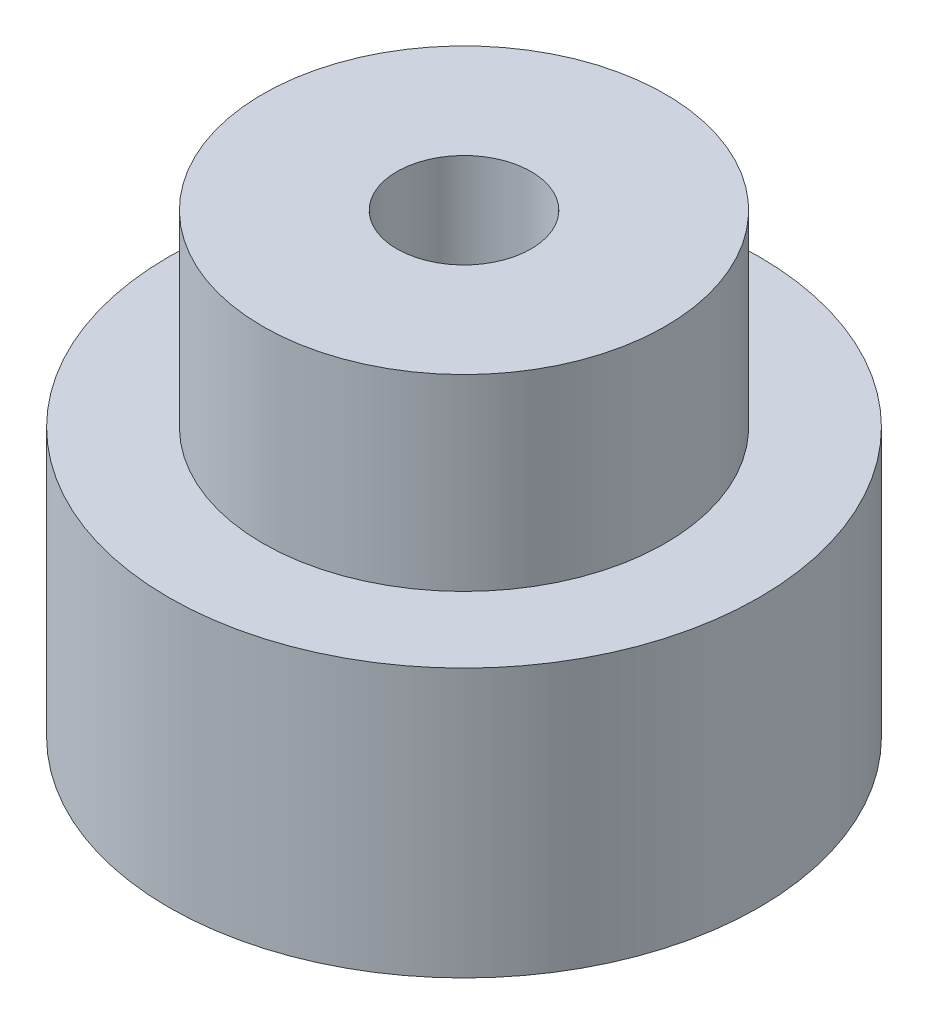
ISO-10303-21;
HEADER;
FILE_DESCRIPTION(('STEP AP214'),'2;1');
FILE_NAME('part.step','',(''),(''),'','','');
FILE_SCHEMA(('AUTOMOTIVE_DESIGN { 1 0 10303 214 1 1 1 1 }'));
ENDSEC;
DATA;
#1=APPLICATION_CONTEXT('core data for automotive mechanical design processes');
#2=APPLICATION_PROTOCOL_DEFINITION('international standard','automotive_design',2000,#1);
#3=PRODUCT_CONTEXT('',#1,'mechanical');
#4=PRODUCT('Part','Part','',(#3));
#5=PRODUCT_RELATED_PRODUCT_CATEGORY('part','',(#4));
#6=PRODUCT_DEFINITION_FORMATION('','',#4);
#7=PRODUCT_DEFINITION_CONTEXT('part definition',#1,'design');
#8=PRODUCT_DEFINITION('design','',#6,#7);
#9=PRODUCT_DEFINITION_SHAPE('','',#8);
#10=(LENGTH_UNIT() NAMED_UNIT(*) SI_UNIT(.MILLI.,.METRE.));
#11=(NAMED_UNIT(*) PLANE_ANGLE_UNIT() SI_UNIT($,.RADIAN.));
#12=(NAMED_UNIT(*) SI_UNIT($,.STERADIAN.) SOLID_ANGLE_UNIT());
#13=UNCERTAINTY_MEASURE_WITH_UNIT(LENGTH_MEASURE(1.E-05),#10,'distance_accuracy_value','');
#14=(GEOMETRIC_REPRESENTATION_CONTEXT(3) GLOBAL_UNCERTAINTY_ASSIGNED_CONTEXT((#13)) GLOBAL_UNIT_ASSIGNED_CONTEXT((#10,
#11,#12)) REPRESENTATION_CONTEXT('',''));
#15=CARTESIAN_POINT('',(0.,0.,0.));
#16=DIRECTION('',(0.,0.,1.));
#17=DIRECTION('',(1.,0.,0.));
#18=AXIS2_PLACEMENT_3D('',#15,#16,#17);
#19=CARTESIAN_POINT('',(0.,-10.,0.));
#20=DIRECTION('',(0.,1.,0.));
#21=DIRECTION('',(0.,0.,1.));
#22=AXIS2_PLACEMENT_3D('',#19,#20,#21);
#23=CYLINDRICAL_SURFACE('',#22,11.);
#24=CARTESIAN_POINT('',(0.,-10.,0.));
#25=DIRECTION('',(0.,1.,0.));
#26=DIRECTION('',(0.,0.,1.));
#27=AXIS2_PLACEMENT_3D('',#24,#25,#26);
#28=CIRCLE('',#27,11.);
#29=CARTESIAN_POINT('',(0.,-10.,11.));
#30=VERTEX_POINT('',#29);
#31=EDGE_CURVE('E10',#30,#30,#28,.T.);
#32=ORIENTED_EDGE('',*,*,#31,.T.);
#33=EDGE_LOOP('',(#32));
#34=FACE_BOUND('',#33,.T.);
#35=CARTESIAN_POINT('',(0.,0.,0.));
#36=DIRECTION('',(0.,1.,0.));
#37=DIRECTION('',(0.,0.,1.));
#38=AXIS2_PLACEMENT_3D('',#35,#36,#37);
#39=CIRCLE('',#38,11.);
#40=CARTESIAN_POINT('',(0.,0.,11.));
#41=VERTEX_POINT('',#40);
#42=EDGE_CURVE('E37',#41,#41,#39,.T.);
#43=ORIENTED_EDGE('',*,*,#42,.F.);
#44=EDGE_LOOP('',(#43));
#45=FACE_BOUND('',#44,.T.);
#46=ADVANCED_FACE('F30',(#34,#45),#23,.T.);
#47=CARTESIAN_POINT('',(0.,-10.,0.));
#48=DIRECTION('',(0.,1.,0.));
#49=DIRECTION('',(0.,0.,1.));
#50=AXIS2_PLACEMENT_3D('',#47,#48,#49);
#51=PLANE('',#50);
#52=CARTESIAN_POINT('',(0.,-10.,0.));
#53=DIRECTION('',(0.,1.,0.));
#54=DIRECTION('',(0.,0.,1.));
#55=AXIS2_PLACEMENT_3D('',#52,#53,#54);
#56=CIRCLE('',#55,2.5);
#57=CARTESIAN_POINT('',(0.,-10.,2.5));
#58=VERTEX_POINT('',#57);
#59=EDGE_CURVE('E47',#58,#58,#56,.F.);
#60=ORIENTED_EDGE('',*,*,#59,.F.);
#61=EDGE_LOOP('',(#60));
#62=FACE_BOUND('',#61,.T.);
#63=ORIENTED_EDGE('',*,*,#31,.F.);
#64=EDGE_LOOP('',(#63));
#65=FACE_BOUND('',#64,.T.);
#66=ADVANCED_FACE('F68',(#62,#65),#51,.F.);
#67=CARTESIAN_POINT('',(0.,0.,0.));
#68=DIRECTION('',(0.,1.,0.));
#69=DIRECTION('',(0.,0.,1.));
#70=AXIS2_PLACEMENT_3D('',#67,#68,#69);
#71=PLANE('',#70);
#72=CARTESIAN_POINT('',(0.,0.,0.));
#73=DIRECTION('',(0.,1.,0.));
#74=DIRECTION('',(0.,0.,1.));
#75=AXIS2_PLACEMENT_3D('',#72,#73,#74);
#76=CIRCLE('',#75,7.5);
#77=CARTESIAN_POINT('',(0.,0.,7.5));
#78=VERTEX_POINT('',#77);
#79=EDGE_CURVE('E44',#78,#78,#76,.T.);
#80=ORIENTED_EDGE('',*,*,#79,.F.);
#81=EDGE_LOOP('',(#80));
#82=FACE_BOUND('',#81,.T.);
#83=ORIENTED_EDGE('',*,*,#42,.T.);
#84=EDGE_LOOP('',(#83));
#85=FACE_BOUND('',#84,.T.);
#86=ADVANCED_FACE('F72',(#82,#85),#71,.T.);
#87=CARTESIAN_POINT('',(0.,7.,0.));
#88=DIRECTION('',(0.,-1.,0.));
#89=DIRECTION('',(0.,0.,-1.));
#90=AXIS2_PLACEMENT_3D('',#87,#88,#89);
#91=CYLINDRICAL_SURFACE('',#90,7.5);
#92=CARTESIAN_POINT('',(0.,7.,0.));
#93=DIRECTION('',(0.,1.,0.));
#94=DIRECTION('',(0.,0.,1.));
#95=AXIS2_PLACEMENT_3D('',#92,#93,#94);
#96=CIRCLE('',#95,7.5);
#97=CARTESIAN_POINT('',(0.,7.,7.5));
#98=VERTEX_POINT('',#97);
#99=EDGE_CURVE('E42',#98,#98,#96,.T.);
#100=ORIENTED_EDGE('',*,*,#99,.F.);
#101=EDGE_LOOP('',(#100));
#102=FACE_BOUND('',#101,.T.);
#103=ORIENTED_EDGE('',*,*,#79,.T.);
#104=EDGE_LOOP('',(#103));
#105=FACE_BOUND('',#104,.T.);
#106=ADVANCED_FACE('F65',(#102,#105),#91,.T.);
#107=CARTESIAN_POINT('',(0.,7.,0.));
#108=DIRECTION('',(0.,1.,0.));
#109=DIRECTION('',(0.,0.,1.));
#110=AXIS2_PLACEMENT_3D('',#107,#108,#109);
#111=PLANE('',#110);
#112=CARTESIAN_POINT('',(0.,7.,0.));
#113=DIRECTION('',(0.,1.,0.));
#114=DIRECTION('',(0.,0.,1.));
#115=AXIS2_PLACEMENT_3D('',#112,#113,#114);
#116=CIRCLE('',#115,2.5);
#117=CARTESIAN_POINT('',(0.,7.,2.5));
#118=VERTEX_POINT('',#117);
#119=EDGE_CURVE('E33',#118,#118,#116,.F.);
#120=ORIENTED_EDGE('',*,*,#119,.T.);
#121=EDGE_LOOP('',(#120));
#122=FACE_BOUND('',#121,.T.);
#123=ORIENTED_EDGE('',*,*,#99,.T.);
#124=EDGE_LOOP('',(#123));
#125=FACE_BOUND('',#124,.T.);
#126=ADVANCED_FACE('F56',(#122,#125),#111,.T.);
#127=CARTESIAN_POINT('',(0.,10.,0.));
#128=DIRECTION('',(0.,-1.,0.));
#129=DIRECTION('',(0.,0.,-1.));
#130=AXIS2_PLACEMENT_3D('',#127,#128,#129);
#131=CYLINDRICAL_SURFACE('',#130,2.5);
#132=ORIENTED_EDGE('',*,*,#119,.F.);
#133=EDGE_LOOP('',(#132));
#134=FACE_BOUND('',#133,.T.);
#135=ORIENTED_EDGE('',*,*,#59,.T.);
#136=EDGE_LOOP('',(#135));
#137=FACE_BOUND('',#136,.T.);
#138=ADVANCED_FACE('F59',(#134,#137),#131,.F.);
#139=CLOSED_SHELL('',(#46,#66,#86,#106,#126,#138));
#140=MANIFOLD_SOLID_BREP('B2',#139);
#141=ADVANCED_BREP_SHAPE_REPRESENTATION('',(#18,#140),#14);
#142=SHAPE_DEFINITION_REPRESENTATION(#9,#141);
ENDSEC;
END-ISO-10303-21;
